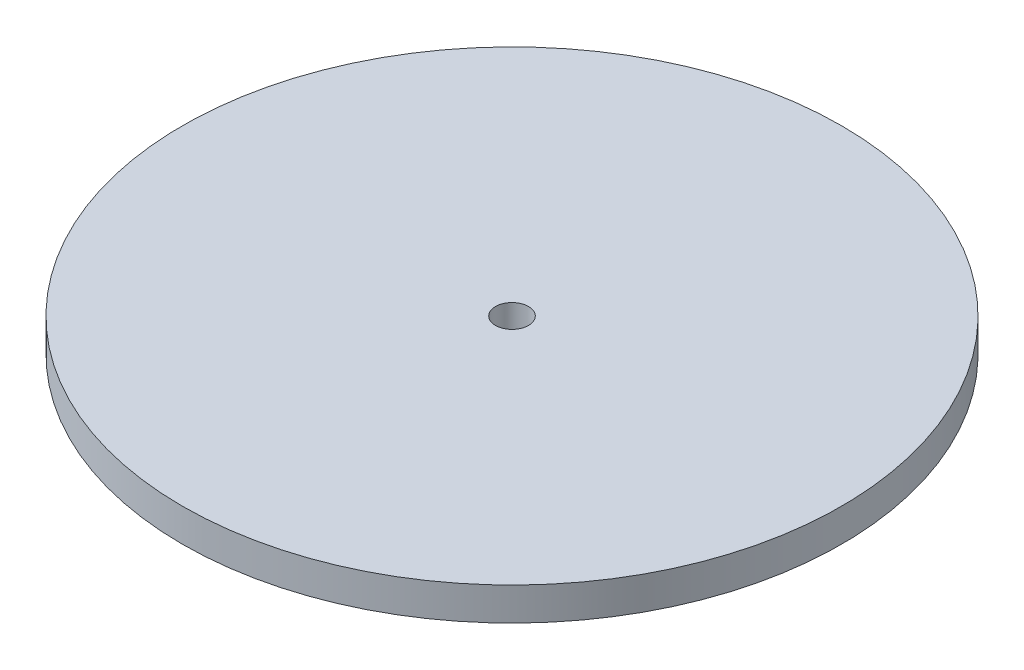
ISO-10303-21;
HEADER;
FILE_DESCRIPTION(('STEP AP214'),'2;1');
FILE_NAME('part.step','',(''),(''),'','','');
FILE_SCHEMA(('AUTOMOTIVE_DESIGN { 1 0 10303 214 1 1 1 1 }'));
ENDSEC;
DATA;
#1=APPLICATION_CONTEXT('core data for automotive mechanical design processes');
#2=APPLICATION_PROTOCOL_DEFINITION('international standard','automotive_design',2000,#1);
#3=PRODUCT_CONTEXT('',#1,'mechanical');
#4=PRODUCT('Part','Part','',(#3));
#5=PRODUCT_RELATED_PRODUCT_CATEGORY('part','',(#4));
#6=PRODUCT_DEFINITION_FORMATION('','',#4);
#7=PRODUCT_DEFINITION_CONTEXT('part definition',#1,'design');
#8=PRODUCT_DEFINITION('design','',#6,#7);
#9=PRODUCT_DEFINITION_SHAPE('','',#8);
#10=(LENGTH_UNIT() NAMED_UNIT(*) SI_UNIT(.MILLI.,.METRE.));
#11=(NAMED_UNIT(*) PLANE_ANGLE_UNIT() SI_UNIT($,.RADIAN.));
#12=(NAMED_UNIT(*) SI_UNIT($,.STERADIAN.) SOLID_ANGLE_UNIT());
#13=UNCERTAINTY_MEASURE_WITH_UNIT(LENGTH_MEASURE(1.E-05),#10,'distance_accuracy_value','');
#14=(GEOMETRIC_REPRESENTATION_CONTEXT(3) GLOBAL_UNCERTAINTY_ASSIGNED_CONTEXT((#13)) GLOBAL_UNIT_ASSIGNED_CONTEXT((#10,
#11,#12)) REPRESENTATION_CONTEXT('',''));
#15=CARTESIAN_POINT('',(0.,0.,0.));
#16=DIRECTION('',(0.,0.,1.));
#17=DIRECTION('',(1.,0.,0.));
#18=AXIS2_PLACEMENT_3D('',#15,#16,#17);
#19=CARTESIAN_POINT('',(0.,6.35,0.));
#20=DIRECTION('',(0.,-1.,0.));
#21=DIRECTION('',(0.,0.,-1.));
#22=AXIS2_PLACEMENT_3D('',#19,#20,#21);
#23=CYLINDRICAL_SURFACE('',#22,63.5);
#24=CARTESIAN_POINT('',(0.,6.35,0.));
#25=DIRECTION('',(0.,1.,0.));
#26=DIRECTION('',(0.,0.,1.));
#27=AXIS2_PLACEMENT_3D('',#24,#25,#26);
#28=CIRCLE('',#27,63.5);
#29=CARTESIAN_POINT('',(0.,6.35,63.5));
#30=VERTEX_POINT('',#29);
#31=EDGE_CURVE('E10',#30,#30,#28,.T.);
#32=ORIENTED_EDGE('',*,*,#31,.F.);
#33=EDGE_LOOP('',(#32));
#34=FACE_BOUND('',#33,.T.);
#35=CARTESIAN_POINT('',(0.,0.,0.));
#36=DIRECTION('',(0.,1.,0.));
#37=DIRECTION('',(0.,0.,1.));
#38=AXIS2_PLACEMENT_3D('',#35,#36,#37);
#39=CIRCLE('',#38,63.5);
#40=CARTESIAN_POINT('',(0.,0.,63.5));
#41=VERTEX_POINT('',#40);
#42=EDGE_CURVE('E44',#41,#41,#39,.T.);
#43=ORIENTED_EDGE('',*,*,#42,.T.);
#44=EDGE_LOOP('',(#43));
#45=FACE_BOUND('',#44,.T.);
#46=ADVANCED_FACE('F41',(#34,#45),#23,.T.);
#47=CARTESIAN_POINT('',(0.,6.35,0.));
#48=DIRECTION('',(0.,1.,0.));
#49=DIRECTION('',(0.,0.,1.));
#50=AXIS2_PLACEMENT_3D('',#47,#48,#49);
#51=PLANE('',#50);
#52=CARTESIAN_POINT('',(0.,6.35,0.));
#53=DIRECTION('',(0.,-1.,0.));
#54=DIRECTION('',(0.,0.,-1.));
#55=AXIS2_PLACEMENT_3D('',#52,#53,#54);
#56=CIRCLE('',#55,3.175);
#57=CARTESIAN_POINT('',(0.,6.35,-3.175));
#58=VERTEX_POINT('',#57);
#59=EDGE_CURVE('E53',#58,#58,#56,.T.);
#60=ORIENTED_EDGE('',*,*,#59,.T.);
#61=EDGE_LOOP('',(#60));
#62=FACE_BOUND('',#61,.T.);
#63=ORIENTED_EDGE('',*,*,#31,.T.);
#64=EDGE_LOOP('',(#63));
#65=FACE_BOUND('',#64,.T.);
#66=ADVANCED_FACE('F68',(#62,#65),#51,.T.);
#67=CARTESIAN_POINT('',(0.,0.,0.));
#68=DIRECTION('',(0.,1.,0.));
#69=DIRECTION('',(0.,0.,1.));
#70=AXIS2_PLACEMENT_3D('',#67,#68,#69);
#71=PLANE('',#70);
#72=CARTESIAN_POINT('',(0.,0.,0.));
#73=DIRECTION('',(0.,-1.,0.));
#74=DIRECTION('',(0.,0.,-1.));
#75=AXIS2_PLACEMENT_3D('',#72,#73,#74);
#76=CIRCLE('',#75,3.175);
#77=CARTESIAN_POINT('',(0.,0.,-3.175));
#78=VERTEX_POINT('',#77);
#79=EDGE_CURVE('E58',#78,#78,#76,.T.);
#80=ORIENTED_EDGE('',*,*,#79,.F.);
#81=EDGE_LOOP('',(#80));
#82=FACE_BOUND('',#81,.T.);
#83=ORIENTED_EDGE('',*,*,#42,.F.);
#84=EDGE_LOOP('',(#83));
#85=FACE_BOUND('',#84,.T.);
#86=ADVANCED_FACE('F65',(#82,#85),#71,.F.);
#87=CARTESIAN_POINT('',(0.,0.,0.));
#88=DIRECTION('',(0.,-1.,0.));
#89=DIRECTION('',(0.,0.,-1.));
#90=AXIS2_PLACEMENT_3D('',#87,#88,#89);
#91=CYLINDRICAL_SURFACE('',#90,3.175);
#92=ORIENTED_EDGE('',*,*,#59,.F.);
#93=EDGE_LOOP('',(#92));
#94=FACE_BOUND('',#93,.T.);
#95=ORIENTED_EDGE('',*,*,#79,.T.);
#96=EDGE_LOOP('',(#95));
#97=FACE_BOUND('',#96,.T.);
#98=ADVANCED_FACE('F63',(#94,#97),#91,.F.);
#99=CLOSED_SHELL('',(#46,#66,#86,#98));
#100=MANIFOLD_SOLID_BREP('B2',#99);
#101=ADVANCED_BREP_SHAPE_REPRESENTATION('',(#18,#100),#14);
#102=SHAPE_DEFINITION_REPRESENTATION(#9,#101);
ENDSEC;
END-ISO-10303-21;
